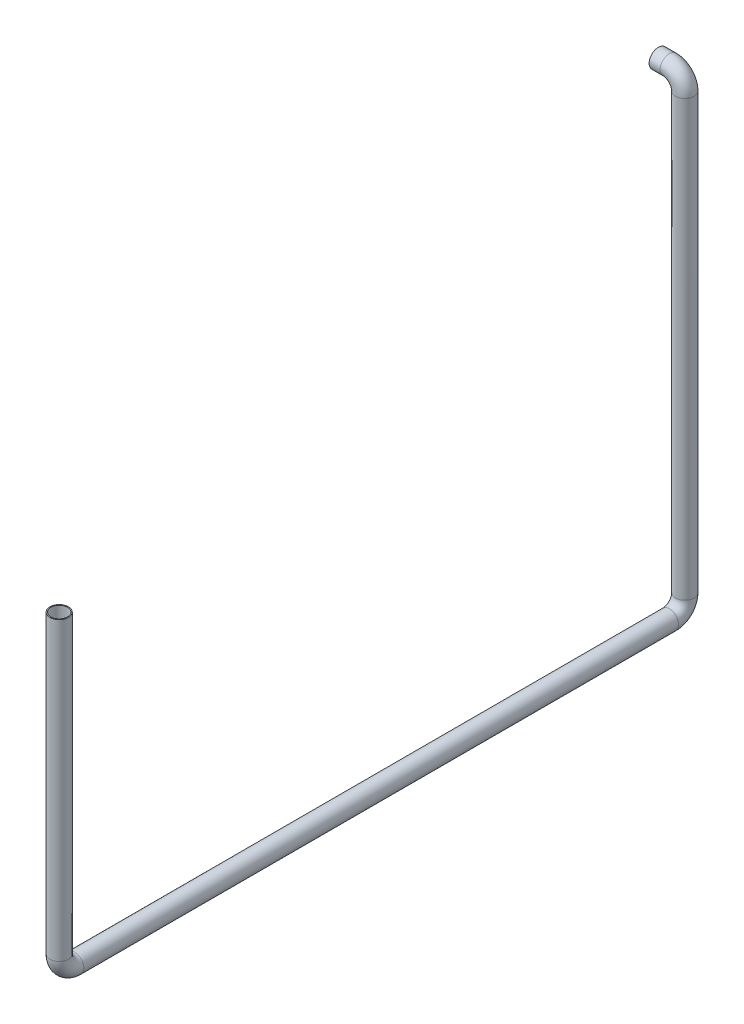
ISO-10303-21;
HEADER;
FILE_DESCRIPTION(('STEP AP214'),'2;1');
FILE_NAME('part.step','',(''),(''),'','','');
FILE_SCHEMA(('AUTOMOTIVE_DESIGN { 1 0 10303 214 1 1 1 1 }'));
ENDSEC;
DATA;
#1=APPLICATION_CONTEXT('core data for automotive mechanical design processes');
#2=APPLICATION_PROTOCOL_DEFINITION('international standard','automotive_design',2000,#1);
#3=PRODUCT_CONTEXT('',#1,'mechanical');
#4=PRODUCT('Part','Part','',(#3));
#5=PRODUCT_RELATED_PRODUCT_CATEGORY('part','',(#4));
#6=PRODUCT_DEFINITION_FORMATION('','',#4);
#7=PRODUCT_DEFINITION_CONTEXT('part definition',#1,'design');
#8=PRODUCT_DEFINITION('design','',#6,#7);
#9=PRODUCT_DEFINITION_SHAPE('','',#8);
#10=(LENGTH_UNIT() NAMED_UNIT(*) SI_UNIT(.MILLI.,.METRE.));
#11=(NAMED_UNIT(*) PLANE_ANGLE_UNIT() SI_UNIT($,.RADIAN.));
#12=(NAMED_UNIT(*) SI_UNIT($,.STERADIAN.) SOLID_ANGLE_UNIT());
#13=UNCERTAINTY_MEASURE_WITH_UNIT(LENGTH_MEASURE(1.E-05),#10,'distance_accuracy_value','');
#14=(GEOMETRIC_REPRESENTATION_CONTEXT(3) GLOBAL_UNCERTAINTY_ASSIGNED_CONTEXT((#13)) GLOBAL_UNIT_ASSIGNED_CONTEXT((#10,
#11,#12)) REPRESENTATION_CONTEXT('',''));
#15=CARTESIAN_POINT('',(0.,0.,0.));
#16=DIRECTION('',(0.,0.,1.));
#17=DIRECTION('',(1.,0.,0.));
#18=AXIS2_PLACEMENT_3D('',#15,#16,#17);
#19=CARTESIAN_POINT('',(-29101.3207914826,-11782.518633414,40870.7001960568));
#20=DIRECTION('',(1.,0.,0.));
#21=DIRECTION('',(0.,0.,-1.));
#22=AXIS2_PLACEMENT_3D('',#19,#20,#21);
#23=PLANE('',#22);
#24=CARTESIAN_POINT('',(-29101.3207914826,-11782.518633414,40870.7001960568));
#25=DIRECTION('',(1.,0.,0.));
#26=DIRECTION('',(0.,0.,-1.));
#27=AXIS2_PLACEMENT_3D('',#24,#25,#26);
#28=CIRCLE('',#27,27.0000000000011);
#29=CARTESIAN_POINT('',(-29101.3207914826,-11782.518633414,40843.7001960568));
#30=VERTEX_POINT('',#29);
#31=EDGE_CURVE('E82',#30,#30,#28,.T.);
#32=ORIENTED_EDGE('',*,*,#31,.T.);
#33=EDGE_LOOP('',(#32));
#34=FACE_BOUND('',#33,.T.);
#35=CARTESIAN_POINT('',(-29101.3207914826,-11782.518633414,40870.7001960568));
#36=DIRECTION('',(1.,0.,0.));
#37=DIRECTION('',(0.,0.,-1.));
#38=AXIS2_PLACEMENT_3D('',#35,#36,#37);
#39=CIRCLE('',#38,30.0000000000011);
#40=CARTESIAN_POINT('',(-29101.3207914826,-11782.518633414,40840.7001960568));
#41=VERTEX_POINT('',#40);
#42=EDGE_CURVE('E75',#41,#41,#39,.T.);
#43=ORIENTED_EDGE('',*,*,#42,.F.);
#44=EDGE_LOOP('',(#43));
#45=FACE_BOUND('',#44,.T.);
#46=ADVANCED_FACE('F47',(#34,#45),#23,.F.);
#47=CARTESIAN_POINT('',(-29015.6176832913,-12281.0654594526,42898.3001960568));
#48=DIRECTION('',(0.,1.,0.));
#49=DIRECTION('',(0.,0.,1.));
#50=AXIS2_PLACEMENT_3D('',#47,#48,#49);
#51=PLANE('',#50);
#52=CARTESIAN_POINT('',(-29015.6176832913,-12281.0654594526,42898.3001960568));
#53=DIRECTION('',(0.,1.,0.));
#54=DIRECTION('',(0.,0.,1.));
#55=AXIS2_PLACEMENT_3D('',#52,#53,#54);
#56=CIRCLE('',#55,27.0000000000011);
#57=CARTESIAN_POINT('',(-29015.6176832913,-12281.0654594526,42925.3001960568));
#58=VERTEX_POINT('',#57);
#59=EDGE_CURVE('E78',#58,#58,#56,.T.);
#60=ORIENTED_EDGE('',*,*,#59,.F.);
#61=EDGE_LOOP('',(#60));
#62=FACE_BOUND('',#61,.T.);
#63=CARTESIAN_POINT('',(-29015.6176832913,-12281.0654594526,42898.3001960568));
#64=DIRECTION('',(0.,1.,0.));
#65=DIRECTION('',(0.,0.,1.));
#66=AXIS2_PLACEMENT_3D('',#63,#64,#65);
#67=CIRCLE('',#66,30.0000000000011);
#68=CARTESIAN_POINT('',(-29015.6176832913,-12281.0654594526,42928.3001960568));
#69=VERTEX_POINT('',#68);
#70=EDGE_CURVE('E11',#69,#69,#67,.T.);
#71=ORIENTED_EDGE('',*,*,#70,.T.);
#72=EDGE_LOOP('',(#71));
#73=FACE_BOUND('',#72,.T.);
#74=ADVANCED_FACE('F131',(#62,#73),#51,.T.);
#75=CARTESIAN_POINT('',(-29101.3207914826,-11782.518633414,40870.7001960568));
#76=DIRECTION('',(1.,0.,0.));
#77=DIRECTION('',(0.,0.,-1.));
#78=AXIS2_PLACEMENT_3D('',#75,#76,#77);
#79=CYLINDRICAL_SURFACE('',#78,30.0000000000011);
#80=CARTESIAN_POINT('',(-29065.6176832913,-11782.518633414,40870.7001960568));
#81=DIRECTION('',(1.,0.,0.));
#82=DIRECTION('',(0.,0.,-1.));
#83=AXIS2_PLACEMENT_3D('',#80,#81,#82);
#84=CIRCLE('',#83,30.0000000000011);
#85=CARTESIAN_POINT('',(-29065.6176832913,-11752.518633416,40870.7001960568));
#86=VERTEX_POINT('',#85);
#87=EDGE_CURVE('E72',#86,#86,#84,.T.);
#88=ORIENTED_EDGE('',*,*,#87,.F.);
#89=EDGE_LOOP('',(#88));
#90=FACE_BOUND('',#89,.T.);
#91=ORIENTED_EDGE('',*,*,#42,.T.);
#92=EDGE_LOOP('',(#91));
#93=FACE_BOUND('',#92,.T.);
#94=ADVANCED_FACE('F133',(#90,#93),#79,.T.);
#95=CARTESIAN_POINT('',(-29065.6176832913,-11832.518633414,40870.7001960568));
#96=DIRECTION('',(0.,0.,-1.));
#97=DIRECTION('',(-1.,0.,0.));
#98=AXIS2_PLACEMENT_3D('',#95,#96,#97);
#99=TOROIDAL_SURFACE('',#98,49.999999997933,30.0000000000011);
#100=CARTESIAN_POINT('',(-29015.6176832913,-11832.518633414,40870.7001960568));
#101=DIRECTION('',(0.,-1.,0.));
#102=DIRECTION('',(0.,0.,-1.));
#103=AXIS2_PLACEMENT_3D('',#100,#101,#102);
#104=CIRCLE('',#103,30.0000000000011);
#105=CARTESIAN_POINT('',(-28985.6176832934,-11832.518633414,40870.7001960568));
#106=VERTEX_POINT('',#105);
#107=EDGE_CURVE('E69',#106,#106,#104,.T.);
#108=CARTESIAN_POINT('',(-29065.6176832913,-11832.518633414,40870.7001960568));
#109=DIRECTION('',(0.,0.,-1.));
#110=DIRECTION('',(-1.,0.,0.));
#111=AXIS2_PLACEMENT_3D('',#108,#109,#110);
#112=CIRCLE('',#111,79.9999999979342);
#113=EDGE_CURVE('',#86,#106,#112,.T.);
#114=ORIENTED_EDGE('',*,*,#87,.T.);
#115=ORIENTED_EDGE('',*,*,#107,.F.);
#116=ORIENTED_EDGE('',*,*,#113,.T.);
#117=ORIENTED_EDGE('',*,*,#113,.F.);
#118=EDGE_LOOP('',(#114,#116,#115,#117));
#119=FACE_BOUND('',#118,.T.);
#120=ADVANCED_FACE('F139',(#119),#99,.T.);
#121=CARTESIAN_POINT('',(-29015.6176832913,-11832.518633414,40870.7001960568));
#122=DIRECTION('',(0.,-1.,0.));
#123=DIRECTION('',(0.,0.,-1.));
#124=AXIS2_PLACEMENT_3D('',#121,#122,#123);
#125=CYLINDRICAL_SURFACE('',#124,30.0000000000011);
#126=CARTESIAN_POINT('',(-29015.6176832913,-13240.4512755421,40870.7001960568));
#127=DIRECTION('',(0.,-1.,0.));
#128=DIRECTION('',(0.,0.,-1.));
#129=AXIS2_PLACEMENT_3D('',#126,#127,#128);
#130=CIRCLE('',#129,30.0000000000011);
#131=CARTESIAN_POINT('',(-29015.6176832913,-13240.4512755421,40840.7001960568));
#132=VERTEX_POINT('',#131);
#133=EDGE_CURVE('E66',#132,#132,#130,.T.);
#134=ORIENTED_EDGE('',*,*,#133,.F.);
#135=EDGE_LOOP('',(#134));
#136=FACE_BOUND('',#135,.T.);
#137=ORIENTED_EDGE('',*,*,#107,.T.);
#138=EDGE_LOOP('',(#137));
#139=FACE_BOUND('',#138,.T.);
#140=ADVANCED_FACE('F174',(#136,#139),#125,.T.);
#141=CARTESIAN_POINT('',(-29015.6176832913,-13240.4512755421,40920.7001960568));
#142=DIRECTION('',(-1.,0.,0.));
#143=DIRECTION('',(0.,0.,1.));
#144=AXIS2_PLACEMENT_3D('',#141,#142,#143);
#145=TOROIDAL_SURFACE('',#144,49.9999999999972,30.0000000000011);
#146=CARTESIAN_POINT('',(-29015.6176832913,-13290.4512755421,40920.7001960568));
#147=DIRECTION('',(0.,0.,1.));
#148=DIRECTION('',(0.,-1.,0.));
#149=AXIS2_PLACEMENT_3D('',#146,#147,#148);
#150=CIRCLE('',#149,30.0000000000011);
#151=CARTESIAN_POINT('',(-29015.6176832913,-13320.4512755421,40920.7001960568));
#152=VERTEX_POINT('',#151);
#153=EDGE_CURVE('E61',#152,#152,#150,.T.);
#154=CARTESIAN_POINT('',(-29015.6176832913,-13240.4512755421,40920.7001960568));
#155=DIRECTION('',(-1.,0.,0.));
#156=DIRECTION('',(0.,0.,1.));
#157=AXIS2_PLACEMENT_3D('',#154,#155,#156);
#158=CIRCLE('',#157,79.9999999999983);
#159=EDGE_CURVE('',#132,#152,#158,.T.);
#160=ORIENTED_EDGE('',*,*,#133,.T.);
#161=ORIENTED_EDGE('',*,*,#153,.F.);
#162=ORIENTED_EDGE('',*,*,#159,.T.);
#163=ORIENTED_EDGE('',*,*,#159,.F.);
#164=EDGE_LOOP('',(#160,#162,#161,#163));
#165=FACE_BOUND('',#164,.T.);
#166=ADVANCED_FACE('F178',(#165),#145,.T.);
#167=CARTESIAN_POINT('',(-29015.6176832913,-13290.4512755421,40920.7001960568));
#168=DIRECTION('',(0.,0.,1.));
#169=DIRECTION('',(1.,0.,0.));
#170=AXIS2_PLACEMENT_3D('',#167,#168,#169);
#171=CYLINDRICAL_SURFACE('',#170,30.0000000000011);
#172=CARTESIAN_POINT('',(-29015.6176832913,-13290.4512755421,42848.3001960568));
#173=DIRECTION('',(0.,0.,1.));
#174=DIRECTION('',(0.,-1.,0.));
#175=AXIS2_PLACEMENT_3D('',#172,#173,#174);
#176=CIRCLE('',#175,30.0000000000011);
#177=CARTESIAN_POINT('',(-29015.6176832913,-13320.4512755421,42848.3001960568));
#178=VERTEX_POINT('',#177);
#179=EDGE_CURVE('E57',#178,#178,#176,.T.);
#180=ORIENTED_EDGE('',*,*,#179,.F.);
#181=EDGE_LOOP('',(#180));
#182=FACE_BOUND('',#181,.T.);
#183=ORIENTED_EDGE('',*,*,#153,.T.);
#184=EDGE_LOOP('',(#183));
#185=FACE_BOUND('',#184,.T.);
#186=ADVANCED_FACE('F127',(#182,#185),#171,.T.);
#187=CARTESIAN_POINT('',(-29015.6176832913,-13240.4512755421,42848.3001960568));
#188=DIRECTION('',(-1.,0.,0.));
#189=DIRECTION('',(0.,0.,1.));
#190=AXIS2_PLACEMENT_3D('',#187,#188,#189);
#191=TOROIDAL_SURFACE('',#190,50.0000000000007,30.0000000000011);
#192=CARTESIAN_POINT('',(-29015.6176832913,-13240.4512755421,42898.3001960568));
#193=DIRECTION('',(0.,1.,0.));
#194=DIRECTION('',(0.,0.,1.));
#195=AXIS2_PLACEMENT_3D('',#192,#193,#194);
#196=CIRCLE('',#195,30.0000000000011);
#197=CARTESIAN_POINT('',(-29015.6176832913,-13240.4512755421,42928.3001960568));
#198=VERTEX_POINT('',#197);
#199=EDGE_CURVE('E53',#198,#198,#196,.T.);
#200=CARTESIAN_POINT('',(-29015.6176832913,-13240.4512755421,42848.3001960568));
#201=DIRECTION('',(-1.,0.,0.));
#202=DIRECTION('',(0.,0.,1.));
#203=AXIS2_PLACEMENT_3D('',#200,#201,#202);
#204=CIRCLE('',#203,80.0000000000018);
#205=EDGE_CURVE('',#178,#198,#204,.T.);
#206=ORIENTED_EDGE('',*,*,#179,.T.);
#207=ORIENTED_EDGE('',*,*,#199,.F.);
#208=ORIENTED_EDGE('',*,*,#205,.T.);
#209=ORIENTED_EDGE('',*,*,#205,.F.);
#210=EDGE_LOOP('',(#206,#208,#207,#209));
#211=FACE_BOUND('',#210,.T.);
#212=ADVANCED_FACE('F121',(#211),#191,.T.);
#213=CARTESIAN_POINT('',(-29015.6176832913,-13240.4512755421,42898.3001960568));
#214=DIRECTION('',(0.,1.,0.));
#215=DIRECTION('',(0.,0.,1.));
#216=AXIS2_PLACEMENT_3D('',#213,#214,#215);
#217=CYLINDRICAL_SURFACE('',#216,30.0000000000011);
#218=ORIENTED_EDGE('',*,*,#70,.F.);
#219=EDGE_LOOP('',(#218));
#220=FACE_BOUND('',#219,.T.);
#221=ORIENTED_EDGE('',*,*,#199,.T.);
#222=EDGE_LOOP('',(#221));
#223=FACE_BOUND('',#222,.T.);
#224=ADVANCED_FACE('F118',(#220,#223),#217,.T.);
#225=CARTESIAN_POINT('',(-29101.3207914826,-11782.518633414,40870.7001960568));
#226=DIRECTION('',(1.,0.,0.));
#227=DIRECTION('',(0.,0.,-1.));
#228=AXIS2_PLACEMENT_3D('',#225,#226,#227);
#229=CYLINDRICAL_SURFACE('',#228,27.0000000000011);
#230=CARTESIAN_POINT('',(-29065.6176832913,-11782.518633416,40870.7001960568));
#231=DIRECTION('',(-1.,0.,0.));
#232=DIRECTION('',(0.,-1.,0.));
#233=AXIS2_PLACEMENT_3D('',#230,#231,#232);
#234=CIRCLE('',#233,27.0000000000011);
#235=CARTESIAN_POINT('',(-29065.6176832913,-11755.518633416,40870.7001960568));
#236=VERTEX_POINT('',#235);
#237=EDGE_CURVE('E85',#236,#236,#234,.F.);
#238=ORIENTED_EDGE('',*,*,#237,.T.);
#239=EDGE_LOOP('',(#238));
#240=FACE_BOUND('',#239,.T.);
#241=ORIENTED_EDGE('',*,*,#31,.F.);
#242=EDGE_LOOP('',(#241));
#243=FACE_BOUND('',#242,.T.);
#244=ADVANCED_FACE('F103',(#240,#243),#229,.F.);
#245=CARTESIAN_POINT('',(-29065.6176832913,-11832.518633414,40870.7001960568));
#246=DIRECTION('',(0.,0.,-1.));
#247=DIRECTION('',(-1.,0.,0.));
#248=AXIS2_PLACEMENT_3D('',#245,#246,#247);
#249=TOROIDAL_SURFACE('',#248,49.999999997933,27.0000000000011);
#250=CARTESIAN_POINT('',(-29015.6176832913,-11832.518633414,40870.7001960568));
#251=DIRECTION('',(0.,-1.,0.));
#252=DIRECTION('',(0.,0.,-1.));
#253=AXIS2_PLACEMENT_3D('',#250,#251,#252);
#254=CIRCLE('',#253,27.0000000000011);
#255=CARTESIAN_POINT('',(-28988.6176832934,-11832.518633414,40870.7001960568));
#256=VERTEX_POINT('',#255);
#257=EDGE_CURVE('E97',#256,#256,#254,.T.);
#258=CARTESIAN_POINT('',(-29065.6176832913,-11832.518633414,40870.7001960568));
#259=DIRECTION('',(0.,0.,-1.));
#260=DIRECTION('',(-1.,0.,0.));
#261=AXIS2_PLACEMENT_3D('',#258,#259,#260);
#262=CIRCLE('',#261,76.9999999979342);
#263=EDGE_CURVE('',#236,#256,#262,.T.);
#264=ORIENTED_EDGE('',*,*,#237,.F.);
#265=ORIENTED_EDGE('',*,*,#257,.T.);
#266=ORIENTED_EDGE('',*,*,#263,.T.);
#267=ORIENTED_EDGE('',*,*,#263,.F.);
#268=EDGE_LOOP('',(#264,#266,#265,#267));
#269=FACE_BOUND('',#268,.T.);
#270=ADVANCED_FACE('F106',(#269),#249,.F.);
#271=CARTESIAN_POINT('',(-29015.6176832913,-11832.518633414,40870.7001960568));
#272=DIRECTION('',(0.,-1.,0.));
#273=DIRECTION('',(0.,0.,-1.));
#274=AXIS2_PLACEMENT_3D('',#271,#272,#273);
#275=CYLINDRICAL_SURFACE('',#274,27.0000000000011);
#276=CARTESIAN_POINT('',(-29015.6176832913,-13240.4512755421,40870.7001960568));
#277=DIRECTION('',(0.,1.,1.7775814861994E-13));
#278=DIRECTION('',(0.,-1.7775814861994E-13,1.));
#279=AXIS2_PLACEMENT_3D('',#276,#277,#278);
#280=CIRCLE('',#279,27.0000000000011);
#281=CARTESIAN_POINT('',(-29015.6176832913,-13240.4512755421,40843.7001960568));
#282=VERTEX_POINT('',#281);
#283=EDGE_CURVE('E94',#282,#282,#280,.F.);
#284=ORIENTED_EDGE('',*,*,#283,.T.);
#285=EDGE_LOOP('',(#284));
#286=FACE_BOUND('',#285,.T.);
#287=ORIENTED_EDGE('',*,*,#257,.F.);
#288=EDGE_LOOP('',(#287));
#289=FACE_BOUND('',#288,.T.);
#290=ADVANCED_FACE('F108',(#286,#289),#275,.F.);
#291=CARTESIAN_POINT('',(-29015.6176832913,-13240.4512755421,40920.7001960568));
#292=DIRECTION('',(-1.,0.,0.));
#293=DIRECTION('',(0.,0.,1.));
#294=AXIS2_PLACEMENT_3D('',#291,#292,#293);
#295=TOROIDAL_SURFACE('',#294,49.9999999999972,27.0000000000011);
#296=CARTESIAN_POINT('',(-29015.6176832913,-13290.4512755421,40920.7001960568));
#297=DIRECTION('',(0.,0.,1.));
#298=DIRECTION('',(1.,0.,0.));
#299=AXIS2_PLACEMENT_3D('',#296,#297,#298);
#300=CIRCLE('',#299,27.0000000000011);
#301=CARTESIAN_POINT('',(-29015.6176832913,-13317.4512755421,40920.7001960568));
#302=VERTEX_POINT('',#301);
#303=EDGE_CURVE('E91',#302,#302,#300,.T.);
#304=CARTESIAN_POINT('',(-29015.6176832913,-13240.4512755421,40920.7001960568));
#305=DIRECTION('',(-1.,0.,0.));
#306=DIRECTION('',(0.,0.,1.));
#307=AXIS2_PLACEMENT_3D('',#304,#305,#306);
#308=CIRCLE('',#307,76.9999999999983);
#309=EDGE_CURVE('',#282,#302,#308,.T.);
#310=ORIENTED_EDGE('',*,*,#283,.F.);
#311=ORIENTED_EDGE('',*,*,#303,.T.);
#312=ORIENTED_EDGE('',*,*,#309,.T.);
#313=ORIENTED_EDGE('',*,*,#309,.F.);
#314=EDGE_LOOP('',(#310,#312,#311,#313));
#315=FACE_BOUND('',#314,.T.);
#316=ADVANCED_FACE('F115',(#315),#295,.F.);
#317=CARTESIAN_POINT('',(-29015.6176832913,-13290.4512755421,40920.7001960568));
#318=DIRECTION('',(0.,0.,1.));
#319=DIRECTION('',(1.,0.,0.));
#320=AXIS2_PLACEMENT_3D('',#317,#318,#319);
#321=CYLINDRICAL_SURFACE('',#320,27.0000000000011);
#322=CARTESIAN_POINT('',(-29015.6176832913,-13290.4512755421,42848.3001960568));
#323=DIRECTION('',(0.,3.55455064899922E-13,-1.));
#324=DIRECTION('',(0.,1.,3.55455064899922E-13));
#325=AXIS2_PLACEMENT_3D('',#322,#323,#324);
#326=CIRCLE('',#325,27.0000000000011);
#327=CARTESIAN_POINT('',(-29015.6176832913,-13317.4512755421,42848.3001960568));
#328=VERTEX_POINT('',#327);
#329=EDGE_CURVE('E88',#328,#328,#326,.F.);
#330=ORIENTED_EDGE('',*,*,#329,.T.);
#331=EDGE_LOOP('',(#330));
#332=FACE_BOUND('',#331,.T.);
#333=ORIENTED_EDGE('',*,*,#303,.F.);
#334=EDGE_LOOP('',(#333));
#335=FACE_BOUND('',#334,.T.);
#336=ADVANCED_FACE('F154',(#332,#335),#321,.F.);
#337=CARTESIAN_POINT('',(-29015.6176832913,-13240.4512755421,42848.3001960568));
#338=DIRECTION('',(-1.,0.,0.));
#339=DIRECTION('',(0.,0.,1.));
#340=AXIS2_PLACEMENT_3D('',#337,#338,#339);
#341=TOROIDAL_SURFACE('',#340,50.0000000000007,27.0000000000011);
#342=CARTESIAN_POINT('',(-29015.6176832913,-13240.4512755421,42898.3001960568));
#343=DIRECTION('',(0.,1.,0.));
#344=DIRECTION('',(0.,0.,1.));
#345=AXIS2_PLACEMENT_3D('',#342,#343,#344);
#346=CIRCLE('',#345,27.0000000000011);
#347=CARTESIAN_POINT('',(-29015.6176832913,-13240.4512755421,42925.3001960568));
#348=VERTEX_POINT('',#347);
#349=EDGE_CURVE('E81',#348,#348,#346,.T.);
#350=CARTESIAN_POINT('',(-29015.6176832913,-13240.4512755421,42848.3001960568));
#351=DIRECTION('',(-1.,0.,0.));
#352=DIRECTION('',(0.,0.,1.));
#353=AXIS2_PLACEMENT_3D('',#350,#351,#352);
#354=CIRCLE('',#353,77.0000000000018);
#355=EDGE_CURVE('',#328,#348,#354,.T.);
#356=ORIENTED_EDGE('',*,*,#329,.F.);
#357=ORIENTED_EDGE('',*,*,#349,.T.);
#358=ORIENTED_EDGE('',*,*,#355,.T.);
#359=ORIENTED_EDGE('',*,*,#355,.F.);
#360=EDGE_LOOP('',(#356,#358,#357,#359));
#361=FACE_BOUND('',#360,.T.);
#362=ADVANCED_FACE('F148',(#361),#341,.F.);
#363=CARTESIAN_POINT('',(-29015.6176832913,-13240.4512755421,42898.3001960568));
#364=DIRECTION('',(0.,1.,0.));
#365=DIRECTION('',(0.,0.,1.));
#366=AXIS2_PLACEMENT_3D('',#363,#364,#365);
#367=CYLINDRICAL_SURFACE('',#366,27.0000000000011);
#368=ORIENTED_EDGE('',*,*,#59,.T.);
#369=EDGE_LOOP('',(#368));
#370=FACE_BOUND('',#369,.T.);
#371=ORIENTED_EDGE('',*,*,#349,.F.);
#372=EDGE_LOOP('',(#371));
#373=FACE_BOUND('',#372,.T.);
#374=ADVANCED_FACE('F143',(#370,#373),#367,.F.);
#375=CLOSED_SHELL('',(#46,#74,#94,#120,#140,#166,#186,#212,#224,#244,#270,#290,#316,#336,#362,#374));
#376=MANIFOLD_SOLID_BREP('B2',#375);
#377=ADVANCED_BREP_SHAPE_REPRESENTATION('',(#18,#376),#14);
#378=SHAPE_DEFINITION_REPRESENTATION(#9,#377);
ENDSEC;
END-ISO-10303-21;
